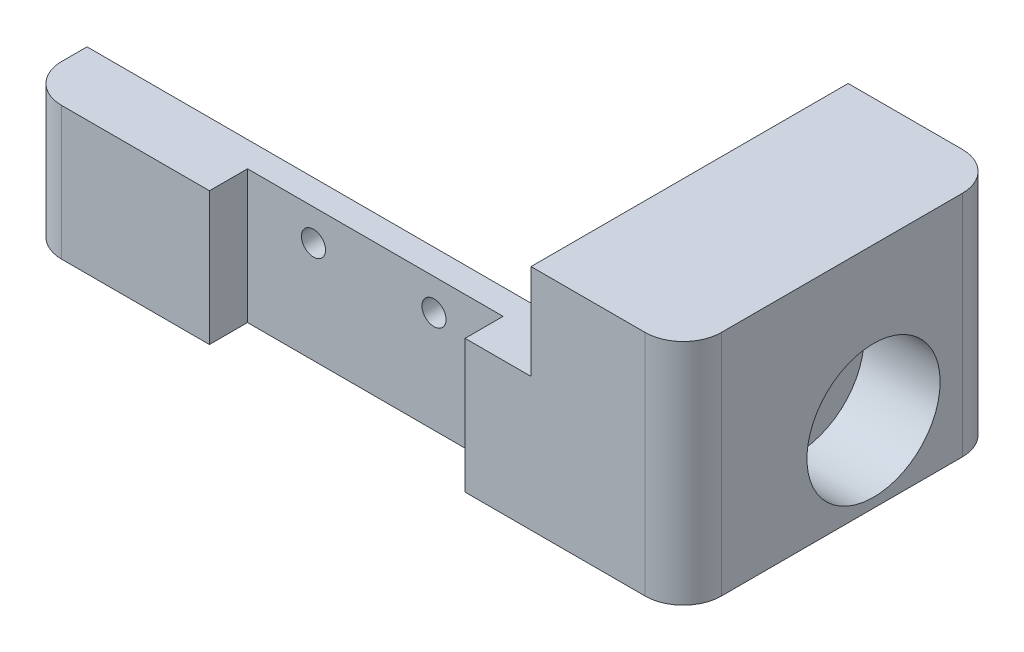
ISO-10303-21;
HEADER;
FILE_DESCRIPTION(('STEP AP214'),'2;1');
FILE_NAME('part.step','',(''),(''),'','','');
FILE_SCHEMA(('AUTOMOTIVE_DESIGN { 1 0 10303 214 1 1 1 1 }'));
ENDSEC;
DATA;
#1=APPLICATION_CONTEXT('core data for automotive mechanical design processes');
#2=APPLICATION_PROTOCOL_DEFINITION('international standard','automotive_design',2000,#1);
#3=PRODUCT_CONTEXT('',#1,'mechanical');
#4=PRODUCT('Part','Part','',(#3));
#5=PRODUCT_RELATED_PRODUCT_CATEGORY('part','',(#4));
#6=PRODUCT_DEFINITION_FORMATION('','',#4);
#7=PRODUCT_DEFINITION_CONTEXT('part definition',#1,'design');
#8=PRODUCT_DEFINITION('design','',#6,#7);
#9=PRODUCT_DEFINITION_SHAPE('','',#8);
#10=(LENGTH_UNIT() NAMED_UNIT(*) SI_UNIT(.MILLI.,.METRE.));
#11=(NAMED_UNIT(*) PLANE_ANGLE_UNIT() SI_UNIT($,.RADIAN.));
#12=(NAMED_UNIT(*) SI_UNIT($,.STERADIAN.) SOLID_ANGLE_UNIT());
#13=UNCERTAINTY_MEASURE_WITH_UNIT(LENGTH_MEASURE(1.E-05),#10,'distance_accuracy_value','');
#14=(GEOMETRIC_REPRESENTATION_CONTEXT(3) GLOBAL_UNCERTAINTY_ASSIGNED_CONTEXT((#13)) GLOBAL_UNIT_ASSIGNED_CONTEXT((#10,
#11,#12)) REPRESENTATION_CONTEXT('',''));
#15=CARTESIAN_POINT('',(0.,0.,0.));
#16=DIRECTION('',(0.,0.,1.));
#17=DIRECTION('',(1.,0.,0.));
#18=AXIS2_PLACEMENT_3D('',#15,#16,#17);
#19=CARTESIAN_POINT('',(0.,0.,2.));
#20=DIRECTION('',(0.,0.,1.));
#21=DIRECTION('',(1.,0.,0.));
#22=AXIS2_PLACEMENT_3D('',#19,#20,#21);
#23=PLANE('',#22);
#24=CARTESIAN_POINT('',(-10.65,8.02270175282018,2.));
#25=DIRECTION('',(0.,0.,1.));
#26=DIRECTION('',(1.,0.,0.));
#27=AXIS2_PLACEMENT_3D('',#24,#25,#26);
#28=CIRCLE('',#27,0.949999999999999);
#29=CARTESIAN_POINT('',(-9.7,8.02270175282018,2.));
#30=VERTEX_POINT('',#29);
#31=EDGE_CURVE('E198',#30,#30,#28,.T.);
#32=ORIENTED_EDGE('',*,*,#31,.F.);
#33=EDGE_LOOP('',(#32));
#34=FACE_BOUND('',#33,.T.);
#35=CARTESIAN_POINT('',(-20.15,8.02270175282018,2.));
#36=DIRECTION('',(0.,0.,1.));
#37=DIRECTION('',(1.,0.,0.));
#38=AXIS2_PLACEMENT_3D('',#35,#36,#37);
#39=CIRCLE('',#38,0.950000000000001);
#40=CARTESIAN_POINT('',(-19.2,8.02270175282018,2.));
#41=VERTEX_POINT('',#40);
#42=EDGE_CURVE('E195',#41,#41,#39,.T.);
#43=ORIENTED_EDGE('',*,*,#42,.F.);
#44=EDGE_LOOP('',(#43));
#45=FACE_BOUND('',#44,.T.);
#46=DIRECTION('',(1.,0.,0.));
#47=VECTOR('',#46,1.);
#48=CARTESIAN_POINT('',(0.,0.,2.));
#49=LINE('',#48,#47);
#50=CARTESIAN_POINT('',(-25.35,0.,2.));
#51=VERTEX_POINT('',#50);
#52=CARTESIAN_POINT('',(-5.2,0.,2.));
#53=VERTEX_POINT('',#52);
#54=EDGE_CURVE('E291',#51,#53,#49,.T.);
#55=ORIENTED_EDGE('',*,*,#54,.T.);
#56=DIRECTION('',(0.,-1.,0.));
#57=VECTOR('',#56,1.);
#58=CARTESIAN_POINT('',(-5.2,10.5,2.));
#59=LINE('',#58,#57);
#60=CARTESIAN_POINT('',(-5.2,10.5,2.));
#61=VERTEX_POINT('',#60);
#62=EDGE_CURVE('E146',#61,#53,#59,.T.);
#63=ORIENTED_EDGE('',*,*,#62,.F.);
#64=DIRECTION('',(-1.,0.,0.));
#65=VECTOR('',#64,1.);
#66=CARTESIAN_POINT('',(0.,10.5,2.));
#67=LINE('',#66,#65);
#68=CARTESIAN_POINT('',(-25.35,10.5,2.));
#69=VERTEX_POINT('',#68);
#70=EDGE_CURVE('E295',#61,#69,#67,.T.);
#71=ORIENTED_EDGE('',*,*,#70,.T.);
#72=DIRECTION('',(0.,1.,0.));
#73=VECTOR('',#72,1.);
#74=CARTESIAN_POINT('',(-25.35,10.5,2.));
#75=LINE('',#74,#73);
#76=EDGE_CURVE('E296',#51,#69,#75,.T.);
#77=ORIENTED_EDGE('',*,*,#76,.F.);
#78=EDGE_LOOP('',(#55,#63,#71,#77));
#79=FACE_BOUND('',#78,.T.);
#80=ADVANCED_FACE('F34',(#34,#45,#79),#23,.T.);
#81=CARTESIAN_POINT('',(0.,10.5,2.));
#82=DIRECTION('',(0.,-1.,0.));
#83=DIRECTION('',(1.,0.,0.));
#84=AXIS2_PLACEMENT_3D('',#81,#82,#83);
#85=PLANE('',#84);
#86=DIRECTION('',(0.,0.,-1.));
#87=VECTOR('',#86,1.);
#88=CARTESIAN_POINT('',(-40.,10.5,2.));
#89=LINE('',#88,#87);
#90=CARTESIAN_POINT('',(-40.,10.5,2.));
#91=VERTEX_POINT('',#90);
#92=CARTESIAN_POINT('',(-40.,10.5,0.));
#93=VERTEX_POINT('',#92);
#94=EDGE_CURVE('E290',#91,#93,#89,.T.);
#95=ORIENTED_EDGE('',*,*,#94,.F.);
#96=CARTESIAN_POINT('',(-37.,10.5,2.));
#97=DIRECTION('',(0.,-1.,0.));
#98=DIRECTION('',(1.,0.,0.));
#99=AXIS2_PLACEMENT_3D('',#96,#97,#98);
#100=CIRCLE('',#99,3.);
#101=CARTESIAN_POINT('',(-37.,10.5,5.));
#102=VERTEX_POINT('',#101);
#103=EDGE_CURVE('E519',#91,#102,#100,.F.);
#104=ORIENTED_EDGE('',*,*,#103,.T.);
#105=DIRECTION('',(-1.,0.,0.));
#106=VECTOR('',#105,1.);
#107=CARTESIAN_POINT('',(-40.,10.5,5.));
#108=LINE('',#107,#106);
#109=CARTESIAN_POINT('',(-25.35,10.5,5.));
#110=VERTEX_POINT('',#109);
#111=EDGE_CURVE('E305',#110,#102,#108,.T.);
#112=ORIENTED_EDGE('',*,*,#111,.F.);
#113=DIRECTION('',(0.,0.,-1.));
#114=VECTOR('',#113,1.);
#115=CARTESIAN_POINT('',(-25.35,10.5,5.));
#116=LINE('',#115,#114);
#117=EDGE_CURVE('E272',#110,#69,#116,.T.);
#118=ORIENTED_EDGE('',*,*,#117,.T.);
#119=ORIENTED_EDGE('',*,*,#70,.F.);
#120=DIRECTION('',(0.,0.,-1.));
#121=VECTOR('',#120,1.);
#122=CARTESIAN_POINT('',(-5.2,10.5,5.));
#123=LINE('',#122,#121);
#124=CARTESIAN_POINT('',(-5.2,10.5,5.));
#125=VERTEX_POINT('',#124);
#126=EDGE_CURVE('E301',#125,#61,#123,.T.);
#127=ORIENTED_EDGE('',*,*,#126,.F.);
#128=DIRECTION('',(-1.,0.,0.));
#129=VECTOR('',#128,1.);
#130=CARTESIAN_POINT('',(0.,10.5,5.));
#131=LINE('',#130,#129);
#132=CARTESIAN_POINT('',(0.,10.5,5.));
#133=VERTEX_POINT('',#132);
#134=EDGE_CURVE('E315',#133,#125,#131,.T.);
#135=ORIENTED_EDGE('',*,*,#134,.F.);
#136=DIRECTION('',(0.,0.,-1.));
#137=VECTOR('',#136,1.);
#138=CARTESIAN_POINT('',(0.,10.5,2.));
#139=LINE('',#138,#137);
#140=CARTESIAN_POINT('',(0.,10.5,0.));
#141=VERTEX_POINT('',#140);
#142=EDGE_CURVE('E293',#133,#141,#139,.T.);
#143=ORIENTED_EDGE('',*,*,#142,.T.);
#144=DIRECTION('',(-1.,0.,0.));
#145=VECTOR('',#144,1.);
#146=CARTESIAN_POINT('',(0.,10.5,0.));
#147=LINE('',#146,#145);
#148=EDGE_CURVE('E265',#141,#93,#147,.T.);
#149=ORIENTED_EDGE('',*,*,#148,.T.);
#150=EDGE_LOOP('',(#95,#104,#112,#118,#119,#127,#135,#143,#149));
#151=FACE_BOUND('',#150,.T.);
#152=ADVANCED_FACE('F218',(#151),#85,.F.);
#153=CARTESIAN_POINT('',(-40.,0.,2.));
#154=DIRECTION('',(1.,0.,0.));
#155=DIRECTION('',(0.,0.,-1.));
#156=AXIS2_PLACEMENT_3D('',#153,#154,#155);
#157=PLANE('',#156);
#158=DIRECTION('',(0.,0.,-1.));
#159=VECTOR('',#158,1.);
#160=CARTESIAN_POINT('',(-40.,0.,2.));
#161=LINE('',#160,#159);
#162=CARTESIAN_POINT('',(-40.,0.,2.));
#163=VERTEX_POINT('',#162);
#164=CARTESIAN_POINT('',(-40.,0.,0.));
#165=VERTEX_POINT('',#164);
#166=EDGE_CURVE('E288',#163,#165,#161,.T.);
#167=ORIENTED_EDGE('',*,*,#166,.F.);
#168=DIRECTION('',(0.,-1.,0.));
#169=VECTOR('',#168,1.);
#170=CARTESIAN_POINT('',(-40.,10.5,2.));
#171=LINE('',#170,#169);
#172=EDGE_CURVE('E518',#163,#91,#171,.F.);
#173=ORIENTED_EDGE('',*,*,#172,.T.);
#174=ORIENTED_EDGE('',*,*,#94,.T.);
#175=DIRECTION('',(0.,-1.,0.));
#176=VECTOR('',#175,1.);
#177=CARTESIAN_POINT('',(-40.,0.,0.));
#178=LINE('',#177,#176);
#179=EDGE_CURVE('E269',#93,#165,#178,.T.);
#180=ORIENTED_EDGE('',*,*,#179,.T.);
#181=EDGE_LOOP('',(#167,#173,#174,#180));
#182=FACE_BOUND('',#181,.T.);
#183=ADVANCED_FACE('F224',(#182),#157,.F.);
#184=CARTESIAN_POINT('',(0.,0.,2.));
#185=DIRECTION('',(0.,1.,0.));
#186=DIRECTION('',(0.,0.,1.));
#187=AXIS2_PLACEMENT_3D('',#184,#185,#186);
#188=PLANE('',#187);
#189=DIRECTION('',(1.,0.,0.));
#190=VECTOR('',#189,1.);
#191=CARTESIAN_POINT('',(-40.,0.,5.));
#192=LINE('',#191,#190);
#193=CARTESIAN_POINT('',(-37.,0.,5.));
#194=VERTEX_POINT('',#193);
#195=CARTESIAN_POINT('',(-25.35,0.,5.));
#196=VERTEX_POINT('',#195);
#197=EDGE_CURVE('E300',#194,#196,#192,.T.);
#198=ORIENTED_EDGE('',*,*,#197,.F.);
#199=CARTESIAN_POINT('',(-37.,0.,2.));
#200=DIRECTION('',(0.,1.,0.));
#201=DIRECTION('',(0.,0.,1.));
#202=AXIS2_PLACEMENT_3D('',#199,#200,#201);
#203=CIRCLE('',#202,3.);
#204=EDGE_CURVE('E520',#194,#163,#203,.F.);
#205=ORIENTED_EDGE('',*,*,#204,.T.);
#206=ORIENTED_EDGE('',*,*,#166,.T.);
#207=DIRECTION('',(1.,0.,0.));
#208=VECTOR('',#207,1.);
#209=CARTESIAN_POINT('',(0.,0.,0.));
#210=LINE('',#209,#208);
#211=CARTESIAN_POINT('',(0.,0.,0.));
#212=VERTEX_POINT('',#211);
#213=EDGE_CURVE('E154',#165,#212,#210,.T.);
#214=ORIENTED_EDGE('',*,*,#213,.T.);
#215=DIRECTION('',(0.,0.,-1.));
#216=VECTOR('',#215,1.);
#217=CARTESIAN_POINT('',(0.,0.,5.));
#218=LINE('',#217,#216);
#219=CARTESIAN_POINT('',(0.,0.,-20.));
#220=VERTEX_POINT('',#219);
#221=EDGE_CURVE('E150',#212,#220,#218,.T.);
#222=ORIENTED_EDGE('',*,*,#221,.T.);
#223=DIRECTION('',(-1.,0.,0.));
#224=VECTOR('',#223,1.);
#225=CARTESIAN_POINT('',(12.,0.,-20.));
#226=LINE('',#225,#224);
#227=CARTESIAN_POINT('',(9.,0.,-20.));
#228=VERTEX_POINT('',#227);
#229=EDGE_CURVE('E137',#228,#220,#226,.T.);
#230=ORIENTED_EDGE('',*,*,#229,.F.);
#231=CARTESIAN_POINT('',(9.,0.,-17.));
#232=DIRECTION('',(0.,1.,0.));
#233=DIRECTION('',(0.,0.,1.));
#234=AXIS2_PLACEMENT_3D('',#231,#232,#233);
#235=CIRCLE('',#234,3.);
#236=CARTESIAN_POINT('',(12.,0.,-17.));
#237=VERTEX_POINT('',#236);
#238=EDGE_CURVE('E533',#228,#237,#235,.F.);
#239=ORIENTED_EDGE('',*,*,#238,.T.);
#240=DIRECTION('',(0.,0.,-1.));
#241=VECTOR('',#240,1.);
#242=CARTESIAN_POINT('',(12.,0.,5.));
#243=LINE('',#242,#241);
#244=CARTESIAN_POINT('',(12.,0.,2.));
#245=VERTEX_POINT('',#244);
#246=EDGE_CURVE('E164',#245,#237,#243,.T.);
#247=ORIENTED_EDGE('',*,*,#246,.F.);
#248=CARTESIAN_POINT('',(9.,0.,2.));
#249=DIRECTION('',(0.,1.,0.));
#250=DIRECTION('',(0.,0.,1.));
#251=AXIS2_PLACEMENT_3D('',#248,#249,#250);
#252=CIRCLE('',#251,3.);
#253=CARTESIAN_POINT('',(9.,0.,5.));
#254=VERTEX_POINT('',#253);
#255=EDGE_CURVE('E524',#245,#254,#252,.F.);
#256=ORIENTED_EDGE('',*,*,#255,.T.);
#257=DIRECTION('',(1.,0.,0.));
#258=VECTOR('',#257,1.);
#259=CARTESIAN_POINT('',(0.,0.,5.));
#260=LINE('',#259,#258);
#261=CARTESIAN_POINT('',(-5.2,0.,5.));
#262=VERTEX_POINT('',#261);
#263=EDGE_CURVE('E321',#262,#254,#260,.T.);
#264=ORIENTED_EDGE('',*,*,#263,.F.);
#265=DIRECTION('',(0.,0.,-1.));
#266=VECTOR('',#265,1.);
#267=CARTESIAN_POINT('',(-5.2,0.,5.));
#268=LINE('',#267,#266);
#269=EDGE_CURVE('E330',#262,#53,#268,.T.);
#270=ORIENTED_EDGE('',*,*,#269,.T.);
#271=ORIENTED_EDGE('',*,*,#54,.F.);
#272=DIRECTION('',(0.,0.,-1.));
#273=VECTOR('',#272,1.);
#274=CARTESIAN_POINT('',(-25.35,0.,5.));
#275=LINE('',#274,#273);
#276=EDGE_CURVE('E267',#196,#51,#275,.T.);
#277=ORIENTED_EDGE('',*,*,#276,.F.);
#278=EDGE_LOOP('',(#198,#205,#206,#214,#222,#230,#239,#247,#256,#264,#270,#271,#277));
#279=FACE_BOUND('',#278,.T.);
#280=ADVANCED_FACE('F152',(#279),#188,.F.);
#281=CARTESIAN_POINT('',(0.,0.,0.));
#282=DIRECTION('',(0.,0.,1.));
#283=DIRECTION('',(1.,0.,0.));
#284=AXIS2_PLACEMENT_3D('',#281,#282,#283);
#285=PLANE('',#284);
#286=CARTESIAN_POINT('',(-10.65,8.02270175282018,0.));
#287=DIRECTION('',(0.,0.,1.));
#288=DIRECTION('',(1.,0.,0.));
#289=AXIS2_PLACEMENT_3D('',#286,#287,#288);
#290=CIRCLE('',#289,0.949999999999999);
#291=CARTESIAN_POINT('',(-9.7,8.02270175282018,0.));
#292=VERTEX_POINT('',#291);
#293=EDGE_CURVE('E38',#292,#292,#290,.T.);
#294=ORIENTED_EDGE('',*,*,#293,.T.);
#295=EDGE_LOOP('',(#294));
#296=FACE_BOUND('',#295,.T.);
#297=CARTESIAN_POINT('',(-20.15,8.02270175282018,0.));
#298=DIRECTION('',(0.,0.,1.));
#299=DIRECTION('',(1.,0.,0.));
#300=AXIS2_PLACEMENT_3D('',#297,#298,#299);
#301=CIRCLE('',#300,0.950000000000001);
#302=CARTESIAN_POINT('',(-19.2,8.02270175282018,0.));
#303=VERTEX_POINT('',#302);
#304=EDGE_CURVE('E194',#303,#303,#301,.T.);
#305=ORIENTED_EDGE('',*,*,#304,.T.);
#306=EDGE_LOOP('',(#305));
#307=FACE_BOUND('',#306,.T.);
#308=DIRECTION('',(0.,1.,0.));
#309=VECTOR('',#308,1.);
#310=CARTESIAN_POINT('',(0.,0.,0.));
#311=LINE('',#310,#309);
#312=EDGE_CURVE('E262',#212,#141,#311,.T.);
#313=ORIENTED_EDGE('',*,*,#312,.F.);
#314=ORIENTED_EDGE('',*,*,#213,.F.);
#315=ORIENTED_EDGE('',*,*,#179,.F.);
#316=ORIENTED_EDGE('',*,*,#148,.F.);
#317=EDGE_LOOP('',(#313,#314,#315,#316));
#318=FACE_BOUND('',#317,.T.);
#319=ADVANCED_FACE('F205',(#296,#307,#318),#285,.F.);
#320=CARTESIAN_POINT('',(-25.35,10.5,5.));
#321=DIRECTION('',(-1.,0.,0.));
#322=DIRECTION('',(0.,-1.,0.));
#323=AXIS2_PLACEMENT_3D('',#320,#321,#322);
#324=PLANE('',#323);
#325=ORIENTED_EDGE('',*,*,#76,.T.);
#326=ORIENTED_EDGE('',*,*,#117,.F.);
#327=DIRECTION('',(0.,1.,0.));
#328=VECTOR('',#327,1.);
#329=CARTESIAN_POINT('',(-25.35,10.5,5.));
#330=LINE('',#329,#328);
#331=EDGE_CURVE('E333',#196,#110,#330,.T.);
#332=ORIENTED_EDGE('',*,*,#331,.F.);
#333=ORIENTED_EDGE('',*,*,#276,.T.);
#334=EDGE_LOOP('',(#325,#326,#332,#333));
#335=FACE_BOUND('',#334,.T.);
#336=ADVANCED_FACE('F230',(#335),#324,.F.);
#337=CARTESIAN_POINT('',(0.,0.,5.));
#338=DIRECTION('',(0.,0.,1.));
#339=DIRECTION('',(1.,0.,0.));
#340=AXIS2_PLACEMENT_3D('',#337,#338,#339);
#341=PLANE('',#340);
#342=ORIENTED_EDGE('',*,*,#111,.T.);
#343=DIRECTION('',(0.,-1.,0.));
#344=VECTOR('',#343,1.);
#345=CARTESIAN_POINT('',(-37.,0.,5.));
#346=LINE('',#345,#344);
#347=EDGE_CURVE('E279',#102,#194,#346,.T.);
#348=ORIENTED_EDGE('',*,*,#347,.T.);
#349=ORIENTED_EDGE('',*,*,#197,.T.);
#350=ORIENTED_EDGE('',*,*,#331,.T.);
#351=EDGE_LOOP('',(#342,#348,#349,#350));
#352=FACE_BOUND('',#351,.T.);
#353=ADVANCED_FACE('F360',(#352),#341,.T.);
#354=CARTESIAN_POINT('',(-5.2,10.5,5.));
#355=DIRECTION('',(1.,0.,0.));
#356=DIRECTION('',(0.,1.,0.));
#357=AXIS2_PLACEMENT_3D('',#354,#355,#356);
#358=PLANE('',#357);
#359=ORIENTED_EDGE('',*,*,#62,.T.);
#360=ORIENTED_EDGE('',*,*,#269,.F.);
#361=DIRECTION('',(0.,-1.,0.));
#362=VECTOR('',#361,1.);
#363=CARTESIAN_POINT('',(-5.2,10.5,5.));
#364=LINE('',#363,#362);
#365=EDGE_CURVE('E317',#125,#262,#364,.T.);
#366=ORIENTED_EDGE('',*,*,#365,.F.);
#367=ORIENTED_EDGE('',*,*,#126,.T.);
#368=EDGE_LOOP('',(#359,#360,#366,#367));
#369=FACE_BOUND('',#368,.T.);
#370=ADVANCED_FACE('F350',(#369),#358,.F.);
#371=CARTESIAN_POINT('',(0.,0.,5.));
#372=DIRECTION('',(0.,0.,-1.));
#373=DIRECTION('',(-1.,0.,0.));
#374=AXIS2_PLACEMENT_3D('',#371,#372,#373);
#375=PLANE('',#374);
#376=ORIENTED_EDGE('',*,*,#263,.T.);
#377=DIRECTION('',(0.,-1.,0.));
#378=VECTOR('',#377,1.);
#379=CARTESIAN_POINT('',(9.,18.,5.));
#380=LINE('',#379,#378);
#381=CARTESIAN_POINT('',(9.,18.,5.));
#382=VERTEX_POINT('',#381);
#383=EDGE_CURVE('E59',#254,#382,#380,.F.);
#384=ORIENTED_EDGE('',*,*,#383,.T.);
#385=DIRECTION('',(-1.,0.,0.));
#386=VECTOR('',#385,1.);
#387=CARTESIAN_POINT('',(12.,18.,5.));
#388=LINE('',#387,#386);
#389=CARTESIAN_POINT('',(0.,18.,5.));
#390=VERTEX_POINT('',#389);
#391=EDGE_CURVE('E170',#382,#390,#388,.T.);
#392=ORIENTED_EDGE('',*,*,#391,.T.);
#393=DIRECTION('',(0.,-1.,0.));
#394=VECTOR('',#393,1.);
#395=CARTESIAN_POINT('',(0.,18.,5.));
#396=LINE('',#395,#394);
#397=EDGE_CURVE('E157',#390,#133,#396,.T.);
#398=ORIENTED_EDGE('',*,*,#397,.T.);
#399=ORIENTED_EDGE('',*,*,#134,.T.);
#400=ORIENTED_EDGE('',*,*,#365,.T.);
#401=EDGE_LOOP('',(#376,#384,#392,#398,#399,#400));
#402=FACE_BOUND('',#401,.T.);
#403=ADVANCED_FACE('F351',(#402),#375,.F.);
#404=CARTESIAN_POINT('',(0.,0.,0.));
#405=DIRECTION('',(1.,0.,0.));
#406=DIRECTION('',(0.,0.,-1.));
#407=AXIS2_PLACEMENT_3D('',#404,#405,#406);
#408=PLANE('',#407);
#409=CARTESIAN_POINT('',(0.,6.,-10.));
#410=DIRECTION('',(1.,0.,0.));
#411=DIRECTION('',(0.,0.,-1.));
#412=AXIS2_PLACEMENT_3D('',#409,#410,#411);
#413=CIRCLE('',#412,2.75);
#414=CARTESIAN_POINT('',(0.,6.,-12.75));
#415=VERTEX_POINT('',#414);
#416=EDGE_CURVE('E175',#415,#415,#413,.T.);
#417=ORIENTED_EDGE('',*,*,#416,.T.);
#418=EDGE_LOOP('',(#417));
#419=FACE_BOUND('',#418,.T.);
#420=ORIENTED_EDGE('',*,*,#221,.F.);
#421=ORIENTED_EDGE('',*,*,#312,.T.);
#422=ORIENTED_EDGE('',*,*,#142,.F.);
#423=ORIENTED_EDGE('',*,*,#397,.F.);
#424=DIRECTION('',(0.,0.,1.));
#425=VECTOR('',#424,1.);
#426=CARTESIAN_POINT('',(0.,18.,5.));
#427=LINE('',#426,#425);
#428=CARTESIAN_POINT('',(0.,18.,-20.));
#429=VERTEX_POINT('',#428);
#430=EDGE_CURVE('E162',#429,#390,#427,.T.);
#431=ORIENTED_EDGE('',*,*,#430,.F.);
#432=DIRECTION('',(0.,1.,0.));
#433=VECTOR('',#432,1.);
#434=CARTESIAN_POINT('',(0.,18.,-20.));
#435=LINE('',#434,#433);
#436=EDGE_CURVE('E141',#220,#429,#435,.T.);
#437=ORIENTED_EDGE('',*,*,#436,.F.);
#438=EDGE_LOOP('',(#420,#421,#422,#423,#431,#437));
#439=FACE_BOUND('',#438,.T.);
#440=ADVANCED_FACE('F159',(#419,#439),#408,.F.);
#441=CARTESIAN_POINT('',(12.,18.,-20.));
#442=DIRECTION('',(0.,0.,1.));
#443=DIRECTION('',(1.,0.,0.));
#444=AXIS2_PLACEMENT_3D('',#441,#442,#443);
#445=PLANE('',#444);
#446=DIRECTION('',(-1.,0.,0.));
#447=VECTOR('',#446,1.);
#448=CARTESIAN_POINT('',(12.,18.,-20.));
#449=LINE('',#448,#447);
#450=CARTESIAN_POINT('',(9.,18.,-20.));
#451=VERTEX_POINT('',#450);
#452=EDGE_CURVE('E147',#451,#429,#449,.T.);
#453=ORIENTED_EDGE('',*,*,#452,.F.);
#454=DIRECTION('',(0.,1.,0.));
#455=VECTOR('',#454,1.);
#456=CARTESIAN_POINT('',(9.,0.,-20.));
#457=LINE('',#456,#455);
#458=EDGE_CURVE('E11',#451,#228,#457,.F.);
#459=ORIENTED_EDGE('',*,*,#458,.T.);
#460=ORIENTED_EDGE('',*,*,#229,.T.);
#461=ORIENTED_EDGE('',*,*,#436,.T.);
#462=EDGE_LOOP('',(#453,#459,#460,#461));
#463=FACE_BOUND('',#462,.T.);
#464=ADVANCED_FACE('F139',(#463),#445,.F.);
#465=CARTESIAN_POINT('',(12.,18.,5.));
#466=DIRECTION('',(0.,-1.,0.));
#467=DIRECTION('',(0.,0.,-1.));
#468=AXIS2_PLACEMENT_3D('',#465,#466,#467);
#469=PLANE('',#468);
#470=ORIENTED_EDGE('',*,*,#391,.F.);
#471=CARTESIAN_POINT('',(9.,18.,2.));
#472=DIRECTION('',(0.,-1.,0.));
#473=DIRECTION('',(0.,0.,-1.));
#474=AXIS2_PLACEMENT_3D('',#471,#472,#473);
#475=CIRCLE('',#474,3.);
#476=CARTESIAN_POINT('',(12.,18.,2.));
#477=VERTEX_POINT('',#476);
#478=EDGE_CURVE('E43',#382,#477,#475,.F.);
#479=ORIENTED_EDGE('',*,*,#478,.T.);
#480=DIRECTION('',(0.,0.,1.));
#481=VECTOR('',#480,1.);
#482=CARTESIAN_POINT('',(12.,18.,5.));
#483=LINE('',#482,#481);
#484=CARTESIAN_POINT('',(12.,18.,-17.));
#485=VERTEX_POINT('',#484);
#486=EDGE_CURVE('E172',#485,#477,#483,.T.);
#487=ORIENTED_EDGE('',*,*,#486,.F.);
#488=CARTESIAN_POINT('',(9.,18.,-17.));
#489=DIRECTION('',(0.,-1.,0.));
#490=DIRECTION('',(0.,0.,-1.));
#491=AXIS2_PLACEMENT_3D('',#488,#489,#490);
#492=CIRCLE('',#491,3.);
#493=EDGE_CURVE('E51',#485,#451,#492,.F.);
#494=ORIENTED_EDGE('',*,*,#493,.T.);
#495=ORIENTED_EDGE('',*,*,#452,.T.);
#496=ORIENTED_EDGE('',*,*,#430,.T.);
#497=EDGE_LOOP('',(#470,#479,#487,#494,#495,#496));
#498=FACE_BOUND('',#497,.T.);
#499=ADVANCED_FACE('F496',(#498),#469,.F.);
#500=CARTESIAN_POINT('',(12.,0.,0.));
#501=DIRECTION('',(1.,0.,0.));
#502=DIRECTION('',(0.,0.,-1.));
#503=AXIS2_PLACEMENT_3D('',#500,#501,#502);
#504=PLANE('',#503);
#505=CARTESIAN_POINT('',(12.,6.,-10.));
#506=DIRECTION('',(1.,0.,0.));
#507=DIRECTION('',(0.,0.,-1.));
#508=AXIS2_PLACEMENT_3D('',#505,#506,#507);
#509=CIRCLE('',#508,5.24999999999999);
#510=CARTESIAN_POINT('',(12.,6.,-15.25));
#511=VERTEX_POINT('',#510);
#512=EDGE_CURVE('E191',#511,#511,#509,.T.);
#513=ORIENTED_EDGE('',*,*,#512,.F.);
#514=EDGE_LOOP('',(#513));
#515=FACE_BOUND('',#514,.T.);
#516=ORIENTED_EDGE('',*,*,#486,.T.);
#517=DIRECTION('',(0.,-1.,0.));
#518=VECTOR('',#517,1.);
#519=CARTESIAN_POINT('',(12.,0.,2.));
#520=LINE('',#519,#518);
#521=EDGE_CURVE('E253',#477,#245,#520,.T.);
#522=ORIENTED_EDGE('',*,*,#521,.T.);
#523=ORIENTED_EDGE('',*,*,#246,.T.);
#524=DIRECTION('',(0.,1.,0.));
#525=VECTOR('',#524,1.);
#526=CARTESIAN_POINT('',(12.,18.,-17.));
#527=LINE('',#526,#525);
#528=EDGE_CURVE('E522',#237,#485,#527,.T.);
#529=ORIENTED_EDGE('',*,*,#528,.T.);
#530=EDGE_LOOP('',(#516,#522,#523,#529));
#531=FACE_BOUND('',#530,.T.);
#532=ADVANCED_FACE('F419',(#515,#531),#504,.T.);
#533=CARTESIAN_POINT('',(12.,6.,-10.));
#534=DIRECTION('',(1.,0.,0.));
#535=DIRECTION('',(0.,0.,-1.));
#536=AXIS2_PLACEMENT_3D('',#533,#534,#535);
#537=CYLINDRICAL_SURFACE('',#536,2.75);
#538=ORIENTED_EDGE('',*,*,#416,.F.);
#539=EDGE_LOOP('',(#538));
#540=FACE_BOUND('',#539,.T.);
#541=CARTESIAN_POINT('',(6.,6.,-10.));
#542=DIRECTION('',(1.,0.,0.));
#543=DIRECTION('',(0.,0.,-1.));
#544=AXIS2_PLACEMENT_3D('',#541,#542,#543);
#545=CIRCLE('',#544,2.75000000000001);
#546=CARTESIAN_POINT('',(6.,6.,-12.75));
#547=VERTEX_POINT('',#546);
#548=EDGE_CURVE('E185',#547,#547,#545,.T.);
#549=ORIENTED_EDGE('',*,*,#548,.T.);
#550=EDGE_LOOP('',(#549));
#551=FACE_BOUND('',#550,.T.);
#552=ADVANCED_FACE('F409',(#540,#551),#537,.F.);
#553=CARTESIAN_POINT('',(6.,8.75000000000001,-10.));
#554=DIRECTION('',(-1.,0.,0.));
#555=DIRECTION('',(0.,0.,1.));
#556=AXIS2_PLACEMENT_3D('',#553,#554,#555);
#557=PLANE('',#556);
#558=ORIENTED_EDGE('',*,*,#548,.F.);
#559=EDGE_LOOP('',(#558));
#560=FACE_BOUND('',#559,.T.);
#561=CARTESIAN_POINT('',(6.,6.,-10.));
#562=DIRECTION('',(1.,0.,0.));
#563=DIRECTION('',(0.,0.,-1.));
#564=AXIS2_PLACEMENT_3D('',#561,#562,#563);
#565=CIRCLE('',#564,5.24999999999999);
#566=CARTESIAN_POINT('',(6.,6.,-15.25));
#567=VERTEX_POINT('',#566);
#568=EDGE_CURVE('E188',#567,#567,#565,.T.);
#569=ORIENTED_EDGE('',*,*,#568,.T.);
#570=EDGE_LOOP('',(#569));
#571=FACE_BOUND('',#570,.T.);
#572=ADVANCED_FACE('F398',(#560,#571),#557,.F.);
#573=CARTESIAN_POINT('',(12.,6.,-10.));
#574=DIRECTION('',(1.,0.,0.));
#575=DIRECTION('',(0.,0.,-1.));
#576=AXIS2_PLACEMENT_3D('',#573,#574,#575);
#577=CYLINDRICAL_SURFACE('',#576,5.24999999999999);
#578=ORIENTED_EDGE('',*,*,#568,.F.);
#579=EDGE_LOOP('',(#578));
#580=FACE_BOUND('',#579,.T.);
#581=ORIENTED_EDGE('',*,*,#512,.T.);
#582=EDGE_LOOP('',(#581));
#583=FACE_BOUND('',#582,.T.);
#584=ADVANCED_FACE('F242',(#580,#583),#577,.F.);
#585=CARTESIAN_POINT('',(-37.,0.,2.));
#586=DIRECTION('',(0.,1.,0.));
#587=DIRECTION('',(0.,0.,1.));
#588=AXIS2_PLACEMENT_3D('',#585,#586,#587);
#589=CYLINDRICAL_SURFACE('',#588,3.);
#590=ORIENTED_EDGE('',*,*,#103,.F.);
#591=ORIENTED_EDGE('',*,*,#172,.F.);
#592=ORIENTED_EDGE('',*,*,#204,.F.);
#593=ORIENTED_EDGE('',*,*,#347,.F.);
#594=EDGE_LOOP('',(#590,#591,#592,#593));
#595=FACE_BOUND('',#594,.T.);
#596=ADVANCED_FACE('F239',(#595),#589,.T.);
#597=CARTESIAN_POINT('',(9.,0.,2.));
#598=DIRECTION('',(0.,1.,0.));
#599=DIRECTION('',(0.,0.,1.));
#600=AXIS2_PLACEMENT_3D('',#597,#598,#599);
#601=CYLINDRICAL_SURFACE('',#600,3.);
#602=ORIENTED_EDGE('',*,*,#478,.F.);
#603=ORIENTED_EDGE('',*,*,#383,.F.);
#604=ORIENTED_EDGE('',*,*,#255,.F.);
#605=ORIENTED_EDGE('',*,*,#521,.F.);
#606=EDGE_LOOP('',(#602,#603,#604,#605));
#607=FACE_BOUND('',#606,.T.);
#608=ADVANCED_FACE('F241',(#607),#601,.T.);
#609=CARTESIAN_POINT('',(9.,0.,-17.));
#610=DIRECTION('',(0.,-1.,0.));
#611=DIRECTION('',(0.,0.,-1.));
#612=AXIS2_PLACEMENT_3D('',#609,#610,#611);
#613=CYLINDRICAL_SURFACE('',#612,3.);
#614=ORIENTED_EDGE('',*,*,#238,.F.);
#615=ORIENTED_EDGE('',*,*,#458,.F.);
#616=ORIENTED_EDGE('',*,*,#493,.F.);
#617=ORIENTED_EDGE('',*,*,#528,.F.);
#618=EDGE_LOOP('',(#614,#615,#616,#617));
#619=FACE_BOUND('',#618,.T.);
#620=ADVANCED_FACE('F36',(#619),#613,.T.);
#621=CARTESIAN_POINT('',(-20.15,8.02270175282018,-20.000025));
#622=DIRECTION('',(0.,0.,1.));
#623=DIRECTION('',(1.,0.,0.));
#624=AXIS2_PLACEMENT_3D('',#621,#622,#623);
#625=CYLINDRICAL_SURFACE('',#624,0.950000000000001);
#626=ORIENTED_EDGE('',*,*,#42,.T.);
#627=EDGE_LOOP('',(#626));
#628=FACE_BOUND('',#627,.T.);
#629=ORIENTED_EDGE('',*,*,#304,.F.);
#630=EDGE_LOOP('',(#629));
#631=FACE_BOUND('',#630,.T.);
#632=ADVANCED_FACE('F210',(#628,#631),#625,.F.);
#633=CARTESIAN_POINT('',(-10.65,8.02270175282018,-20.000025));
#634=DIRECTION('',(0.,0.,1.));
#635=DIRECTION('',(1.,0.,0.));
#636=AXIS2_PLACEMENT_3D('',#633,#634,#635);
#637=CYLINDRICAL_SURFACE('',#636,0.949999999999999);
#638=ORIENTED_EDGE('',*,*,#31,.T.);
#639=EDGE_LOOP('',(#638));
#640=FACE_BOUND('',#639,.T.);
#641=ORIENTED_EDGE('',*,*,#293,.F.);
#642=EDGE_LOOP('',(#641));
#643=FACE_BOUND('',#642,.T.);
#644=ADVANCED_FACE('F208',(#640,#643),#637,.F.);
#645=CLOSED_SHELL('',(#80,#152,#183,#280,#319,#336,#353,#370,#403,#440,#464,#499,#532,#552,#572,
#584,#596,#608,#620,#632,#644));
#646=MANIFOLD_SOLID_BREP('B2',#645);
#647=ADVANCED_BREP_SHAPE_REPRESENTATION('',(#18,#646),#14);
#648=SHAPE_DEFINITION_REPRESENTATION(#9,#647);
ENDSEC;
END-ISO-10303-21;
